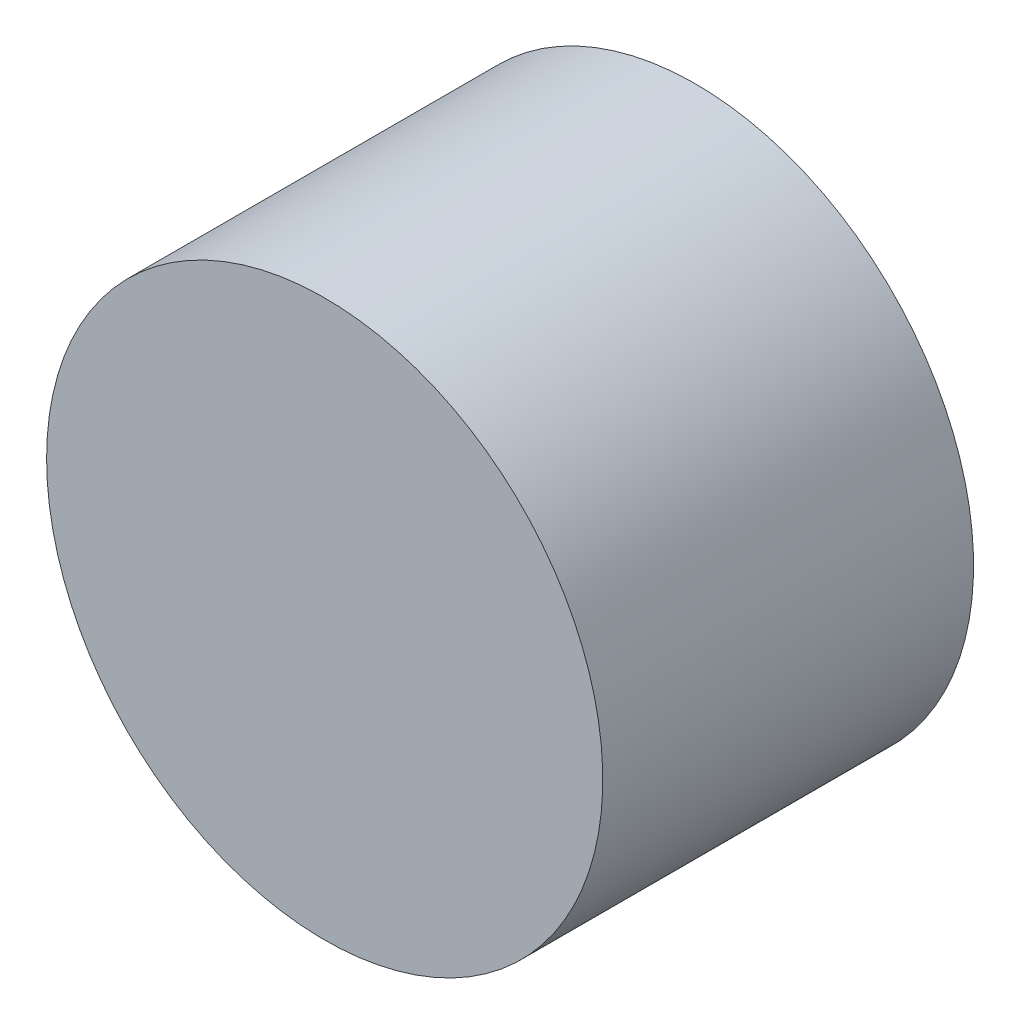
ISO-10303-21;
HEADER;
FILE_DESCRIPTION(('STEP AP214'),'2;1');
FILE_NAME('part.step','',(''),(''),'','','');
FILE_SCHEMA(('AUTOMOTIVE_DESIGN { 1 0 10303 214 1 1 1 1 }'));
ENDSEC;
DATA;
#1=APPLICATION_CONTEXT('core data for automotive mechanical design processes');
#2=APPLICATION_PROTOCOL_DEFINITION('international standard','automotive_design',2000,#1);
#3=PRODUCT_CONTEXT('',#1,'mechanical');
#4=PRODUCT('Part','Part','',(#3));
#5=PRODUCT_RELATED_PRODUCT_CATEGORY('part','',(#4));
#6=PRODUCT_DEFINITION_FORMATION('','',#4);
#7=PRODUCT_DEFINITION_CONTEXT('part definition',#1,'design');
#8=PRODUCT_DEFINITION('design','',#6,#7);
#9=PRODUCT_DEFINITION_SHAPE('','',#8);
#10=(LENGTH_UNIT() NAMED_UNIT(*) SI_UNIT(.MILLI.,.METRE.));
#11=(NAMED_UNIT(*) PLANE_ANGLE_UNIT() SI_UNIT($,.RADIAN.));
#12=(NAMED_UNIT(*) SI_UNIT($,.STERADIAN.) SOLID_ANGLE_UNIT());
#13=UNCERTAINTY_MEASURE_WITH_UNIT(LENGTH_MEASURE(1.E-05),#10,'distance_accuracy_value','');
#14=(GEOMETRIC_REPRESENTATION_CONTEXT(3) GLOBAL_UNCERTAINTY_ASSIGNED_CONTEXT((#13)) GLOBAL_UNIT_ASSIGNED_CONTEXT((#10,
#11,#12)) REPRESENTATION_CONTEXT('',''));
#15=CARTESIAN_POINT('',(0.,0.,0.));
#16=DIRECTION('',(0.,0.,1.));
#17=DIRECTION('',(1.,0.,0.));
#18=AXIS2_PLACEMENT_3D('',#15,#16,#17);
#19=CARTESIAN_POINT('',(0.,0.,12.7));
#20=DIRECTION('',(0.,0.,-1.));
#21=DIRECTION('',(-1.,0.,0.));
#22=AXIS2_PLACEMENT_3D('',#19,#20,#21);
#23=CYLINDRICAL_SURFACE('',#22,9.525);
#24=CARTESIAN_POINT('',(0.,0.,12.7));
#25=DIRECTION('',(0.,0.,1.));
#26=DIRECTION('',(1.,0.,0.));
#27=AXIS2_PLACEMENT_3D('',#24,#25,#26);
#28=CIRCLE('',#27,9.525);
#29=CARTESIAN_POINT('',(-9.525,0.,12.7));
#30=VERTEX_POINT('',#29);
#31=EDGE_CURVE('E10',#30,#30,#28,.T.);
#32=CARTESIAN_POINT('',(0.,0.,0.));
#33=DIRECTION('',(0.,0.,1.));
#34=DIRECTION('',(1.,0.,0.));
#35=AXIS2_PLACEMENT_3D('',#32,#33,#34);
#36=CIRCLE('',#35,9.525);
#37=CARTESIAN_POINT('',(-9.525,0.,0.));
#38=VERTEX_POINT('',#37);
#39=EDGE_CURVE('E34',#38,#38,#36,.T.);
#40=CARTESIAN_POINT('',(-9.525,0.,12.7));
#41=CARTESIAN_POINT('',(-9.525,0.,12.5677083333333));
#42=CARTESIAN_POINT('',(-9.525,0.,12.4354166666667));
#43=CARTESIAN_POINT('',(-9.525,0.,12.1708333333333));
#44=CARTESIAN_POINT('',(-9.525,0.,12.0385416666667));
#45=CARTESIAN_POINT('',(-9.525,0.,11.7739583333333));
#46=CARTESIAN_POINT('',(-9.525,0.,11.6416666666667));
#47=CARTESIAN_POINT('',(-9.525,0.,11.3770833333333));
#48=CARTESIAN_POINT('',(-9.525,0.,11.2447916666667));
#49=CARTESIAN_POINT('',(-9.525,0.,10.9802083333333));
#50=CARTESIAN_POINT('',(-9.525,0.,10.8479166666667));
#51=CARTESIAN_POINT('',(-9.525,0.,10.5833333333333));
#52=CARTESIAN_POINT('',(-9.525,0.,10.4510416666667));
#53=CARTESIAN_POINT('',(-9.525,0.,10.1864583333333));
#54=CARTESIAN_POINT('',(-9.525,0.,10.0541666666667));
#55=CARTESIAN_POINT('',(-9.525,0.,9.78958333333333));
#56=CARTESIAN_POINT('',(-9.525,0.,9.65729166666667));
#57=CARTESIAN_POINT('',(-9.525,0.,9.39270833333333));
#58=CARTESIAN_POINT('',(-9.525,0.,9.26041666666667));
#59=CARTESIAN_POINT('',(-9.525,0.,8.99583333333334));
#60=CARTESIAN_POINT('',(-9.525,0.,8.86354166666667));
#61=CARTESIAN_POINT('',(-9.525,0.,8.59895833333334));
#62=CARTESIAN_POINT('',(-9.525,0.,8.46666666666667));
#63=CARTESIAN_POINT('',(-9.525,0.,8.20208333333333));
#64=CARTESIAN_POINT('',(-9.525,0.,8.06979166666667));
#65=CARTESIAN_POINT('',(-9.525,0.,7.80520833333333));
#66=CARTESIAN_POINT('',(-9.525,0.,7.67291666666667));
#67=CARTESIAN_POINT('',(-9.525,0.,7.40833333333333));
#68=CARTESIAN_POINT('',(-9.525,0.,7.27604166666667));
#69=CARTESIAN_POINT('',(-9.525,0.,7.01145833333333));
#70=CARTESIAN_POINT('',(-9.525,0.,6.87916666666667));
#71=CARTESIAN_POINT('',(-9.525,0.,6.61458333333333));
#72=CARTESIAN_POINT('',(-9.525,0.,6.48229166666667));
#73=CARTESIAN_POINT('',(-9.525,0.,6.21770833333333));
#74=CARTESIAN_POINT('',(-9.525,0.,6.08541666666667));
#75=CARTESIAN_POINT('',(-9.525,0.,5.82083333333333));
#76=CARTESIAN_POINT('',(-9.525,0.,5.68854166666667));
#77=CARTESIAN_POINT('',(-9.525,0.,5.42395833333333));
#78=CARTESIAN_POINT('',(-9.525,0.,5.29166666666667));
#79=CARTESIAN_POINT('',(-9.525,0.,5.02708333333333));
#80=CARTESIAN_POINT('',(-9.525,0.,4.89479166666667));
#81=CARTESIAN_POINT('',(-9.525,0.,4.63020833333333));
#82=CARTESIAN_POINT('',(-9.525,0.,4.49791666666667));
#83=CARTESIAN_POINT('',(-9.525,0.,4.23333333333333));
#84=CARTESIAN_POINT('',(-9.525,0.,4.10104166666667));
#85=CARTESIAN_POINT('',(-9.525,0.,3.83645833333333));
#86=CARTESIAN_POINT('',(-9.525,0.,3.70416666666667));
#87=CARTESIAN_POINT('',(-9.525,0.,3.43958333333333));
#88=CARTESIAN_POINT('',(-9.525,0.,3.30729166666667));
#89=CARTESIAN_POINT('',(-9.525,0.,3.04270833333333));
#90=CARTESIAN_POINT('',(-9.525,0.,2.91041666666667));
#91=CARTESIAN_POINT('',(-9.525,0.,2.64583333333333));
#92=CARTESIAN_POINT('',(-9.525,0.,2.51354166666667));
#93=CARTESIAN_POINT('',(-9.525,0.,2.24895833333333));
#94=CARTESIAN_POINT('',(-9.525,0.,2.11666666666667));
#95=CARTESIAN_POINT('',(-9.525,0.,1.85208333333333));
#96=CARTESIAN_POINT('',(-9.525,0.,1.71979166666667));
#97=CARTESIAN_POINT('',(-9.525,0.,1.45520833333333));
#98=CARTESIAN_POINT('',(-9.525,0.,1.32291666666667));
#99=CARTESIAN_POINT('',(-9.525,0.,1.05833333333333));
#100=CARTESIAN_POINT('',(-9.525,0.,0.926041666666666));
#101=CARTESIAN_POINT('',(-9.525,0.,0.661458333333333));
#102=CARTESIAN_POINT('',(-9.525,0.,0.529166666666666));
#103=CARTESIAN_POINT('',(-9.525,0.,0.264583333333333));
#104=CARTESIAN_POINT('',(-9.525,0.,0.132291666666667));
#105=CARTESIAN_POINT('',(-9.525,0.,0.));
#106=B_SPLINE_CURVE_WITH_KNOTS('',3,(#40,#41,#42,#43,#44,#45,#46,#47,#48,#49,#50,#51,#52,#53,
#54,#55,#56,#57,#58,#59,#60,#61,#62,#63,#64,#65,#66,#67,#68,#69,#70,#71,#72,#73,#74,#75,#76,#77,
#78,#79,#80,#81,#82,#83,#84,#85,#86,#87,#88,#89,#90,#91,#92,#93,#94,#95,#96,#97,#98,#99,#100,
#101,#102,#103,#104,#105),.UNSPECIFIED.,.F.,.F.,(4,2,2,2,2,2,2,2,2,2,2,2,2,2,2,2,2,2,2,2,2,2,2,
2,2,2,2,2,2,2,2,2,4),(0.,0.396875,0.793749999999999,1.190625,1.5875,1.984375,2.38125,2.778125,
3.175,3.571875,3.96875,4.365625,4.7625,5.159375,5.55625,5.953125,6.35,6.746875,7.14375,7.540625,
7.9375,8.334375,8.73125,9.128125,9.525,9.921875,10.31875,10.715625,11.1125,11.509375,11.90625,
12.303125,12.7),.UNSPECIFIED.);
#107=EDGE_CURVE('BSEAM31',#30,#38,#106,.T.);
#108=ORIENTED_EDGE('',*,*,#31,.F.);
#109=ORIENTED_EDGE('',*,*,#39,.T.);
#110=ORIENTED_EDGE('',*,*,#107,.T.);
#111=ORIENTED_EDGE('',*,*,#107,.F.);
#112=EDGE_LOOP('',(#108,#110,#109,#111));
#113=FACE_BOUND('',#112,.T.);
#114=ADVANCED_FACE('F31',(#113),#23,.T.);
#115=CARTESIAN_POINT('',(0.,0.,12.7));
#116=DIRECTION('',(0.,0.,1.));
#117=DIRECTION('',(1.,0.,0.));
#118=AXIS2_PLACEMENT_3D('',#115,#116,#117);
#119=PLANE('',#118);
#120=ORIENTED_EDGE('',*,*,#31,.T.);
#121=EDGE_LOOP('',(#120));
#122=FACE_BOUND('',#121,.T.);
#123=ADVANCED_FACE('F46',(#122),#119,.T.);
#124=CARTESIAN_POINT('',(0.,0.,0.));
#125=DIRECTION('',(0.,0.,1.));
#126=DIRECTION('',(1.,0.,0.));
#127=AXIS2_PLACEMENT_3D('',#124,#125,#126);
#128=PLANE('',#127);
#129=ORIENTED_EDGE('',*,*,#39,.F.);
#130=EDGE_LOOP('',(#129));
#131=FACE_BOUND('',#130,.T.);
#132=ADVANCED_FACE('F44',(#131),#128,.F.);
#133=CLOSED_SHELL('',(#114,#123,#132));
#134=MANIFOLD_SOLID_BREP('B2',#133);
#135=ADVANCED_BREP_SHAPE_REPRESENTATION('',(#18,#134),#14);
#136=SHAPE_DEFINITION_REPRESENTATION(#9,#135);
ENDSEC;
END-ISO-10303-21;
